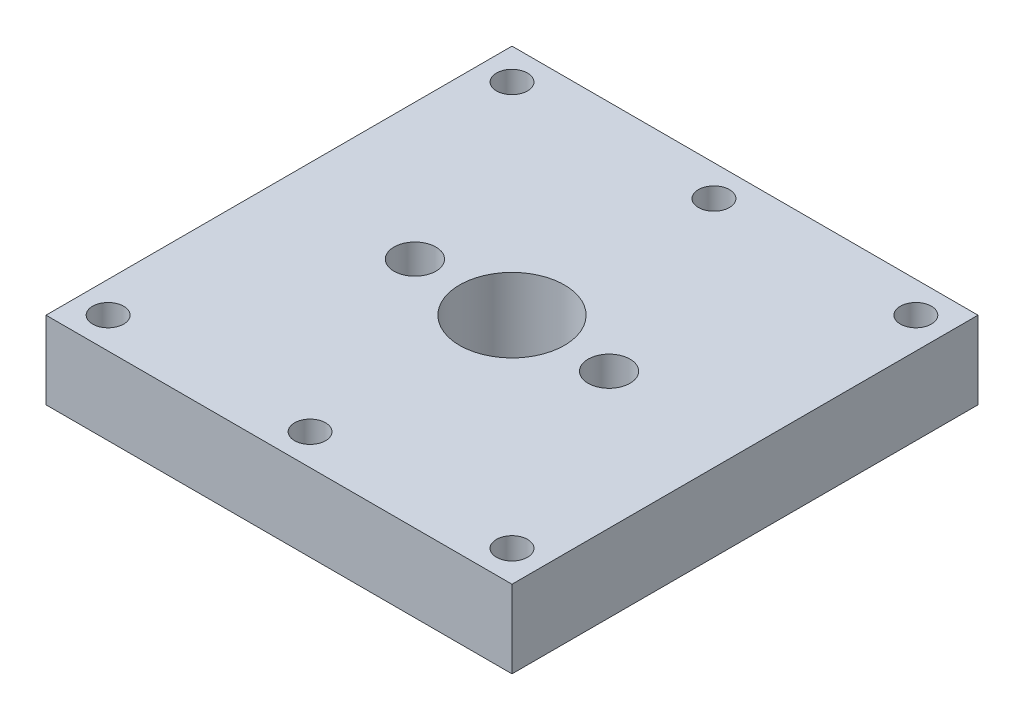
ISO-10303-21;
HEADER;
FILE_DESCRIPTION(('STEP AP214'),'2;1');
FILE_NAME('part.step','',(''),(''),'','','');
FILE_SCHEMA(('AUTOMOTIVE_DESIGN { 1 0 10303 214 1 1 1 1 }'));
ENDSEC;
DATA;
#1=APPLICATION_CONTEXT('core data for automotive mechanical design processes');
#2=APPLICATION_PROTOCOL_DEFINITION('international standard','automotive_design',2000,#1);
#3=PRODUCT_CONTEXT('',#1,'mechanical');
#4=PRODUCT('Part','Part','',(#3));
#5=PRODUCT_RELATED_PRODUCT_CATEGORY('part','',(#4));
#6=PRODUCT_DEFINITION_FORMATION('','',#4);
#7=PRODUCT_DEFINITION_CONTEXT('part definition',#1,'design');
#8=PRODUCT_DEFINITION('design','',#6,#7);
#9=PRODUCT_DEFINITION_SHAPE('','',#8);
#10=(LENGTH_UNIT() NAMED_UNIT(*) SI_UNIT(.MILLI.,.METRE.));
#11=(NAMED_UNIT(*) PLANE_ANGLE_UNIT() SI_UNIT($,.RADIAN.));
#12=(NAMED_UNIT(*) SI_UNIT($,.STERADIAN.) SOLID_ANGLE_UNIT());
#13=UNCERTAINTY_MEASURE_WITH_UNIT(LENGTH_MEASURE(1.E-05),#10,'distance_accuracy_value','');
#14=(GEOMETRIC_REPRESENTATION_CONTEXT(3) GLOBAL_UNCERTAINTY_ASSIGNED_CONTEXT((#13)) GLOBAL_UNIT_ASSIGNED_CONTEXT((#10,
#11,#12)) REPRESENTATION_CONTEXT('',''));
#15=CARTESIAN_POINT('',(0.,0.,0.));
#16=DIRECTION('',(0.,0.,1.));
#17=DIRECTION('',(1.,0.,0.));
#18=AXIS2_PLACEMENT_3D('',#15,#16,#17);
#19=CARTESIAN_POINT('',(-30.,10.,30.));
#20=DIRECTION('',(1.,0.,0.));
#21=DIRECTION('',(0.,0.,-1.));
#22=AXIS2_PLACEMENT_3D('',#19,#20,#21);
#23=PLANE('',#22);
#24=DIRECTION('',(0.,0.,1.));
#25=VECTOR('',#24,1.);
#26=CARTESIAN_POINT('',(-30.,0.,30.));
#27=LINE('',#26,#25);
#28=CARTESIAN_POINT('',(-30.,0.,-30.));
#29=VERTEX_POINT('',#28);
#30=CARTESIAN_POINT('',(-30.,0.,30.));
#31=VERTEX_POINT('',#30);
#32=EDGE_CURVE('E111',#29,#31,#27,.T.);
#33=ORIENTED_EDGE('',*,*,#32,.T.);
#34=DIRECTION('',(0.,-1.,0.));
#35=VECTOR('',#34,1.);
#36=CARTESIAN_POINT('',(-30.,10.,30.));
#37=LINE('',#36,#35);
#38=CARTESIAN_POINT('',(-30.,10.,30.));
#39=VERTEX_POINT('',#38);
#40=EDGE_CURVE('E13',#39,#31,#37,.T.);
#41=ORIENTED_EDGE('',*,*,#40,.F.);
#42=DIRECTION('',(0.,0.,1.));
#43=VECTOR('',#42,1.);
#44=CARTESIAN_POINT('',(-30.,10.,30.));
#45=LINE('',#44,#43);
#46=CARTESIAN_POINT('',(-30.,10.,-30.));
#47=VERTEX_POINT('',#46);
#48=EDGE_CURVE('E99',#47,#39,#45,.T.);
#49=ORIENTED_EDGE('',*,*,#48,.F.);
#50=DIRECTION('',(0.,-1.,0.));
#51=VECTOR('',#50,1.);
#52=CARTESIAN_POINT('',(-30.,10.,-30.));
#53=LINE('',#52,#51);
#54=EDGE_CURVE('E107',#47,#29,#53,.T.);
#55=ORIENTED_EDGE('',*,*,#54,.T.);
#56=EDGE_LOOP('',(#33,#41,#49,#55));
#57=FACE_BOUND('',#56,.T.);
#58=ADVANCED_FACE('F48',(#57),#23,.F.);
#59=CARTESIAN_POINT('',(30.,10.,30.));
#60=DIRECTION('',(0.,0.,-1.));
#61=DIRECTION('',(-1.,0.,0.));
#62=AXIS2_PLACEMENT_3D('',#59,#60,#61);
#63=PLANE('',#62);
#64=DIRECTION('',(1.,0.,0.));
#65=VECTOR('',#64,1.);
#66=CARTESIAN_POINT('',(30.,0.,30.));
#67=LINE('',#66,#65);
#68=CARTESIAN_POINT('',(30.,0.,30.));
#69=VERTEX_POINT('',#68);
#70=EDGE_CURVE('E103',#31,#69,#67,.T.);
#71=ORIENTED_EDGE('',*,*,#70,.T.);
#72=DIRECTION('',(0.,-1.,0.));
#73=VECTOR('',#72,1.);
#74=CARTESIAN_POINT('',(30.,10.,30.));
#75=LINE('',#74,#73);
#76=CARTESIAN_POINT('',(30.,10.,30.));
#77=VERTEX_POINT('',#76);
#78=EDGE_CURVE('E56',#77,#69,#75,.T.);
#79=ORIENTED_EDGE('',*,*,#78,.F.);
#80=DIRECTION('',(1.,0.,0.));
#81=VECTOR('',#80,1.);
#82=CARTESIAN_POINT('',(30.,10.,30.));
#83=LINE('',#82,#81);
#84=EDGE_CURVE('E94',#39,#77,#83,.T.);
#85=ORIENTED_EDGE('',*,*,#84,.F.);
#86=ORIENTED_EDGE('',*,*,#40,.T.);
#87=EDGE_LOOP('',(#71,#79,#85,#86));
#88=FACE_BOUND('',#87,.T.);
#89=ADVANCED_FACE('F102',(#88),#63,.F.);
#90=CARTESIAN_POINT('',(30.,10.,30.));
#91=DIRECTION('',(-1.,0.,0.));
#92=DIRECTION('',(0.,0.,1.));
#93=AXIS2_PLACEMENT_3D('',#90,#91,#92);
#94=PLANE('',#93);
#95=DIRECTION('',(0.,0.,-1.));
#96=VECTOR('',#95,1.);
#97=CARTESIAN_POINT('',(30.,0.,30.));
#98=LINE('',#97,#96);
#99=CARTESIAN_POINT('',(30.,0.,-30.));
#100=VERTEX_POINT('',#99);
#101=EDGE_CURVE('E81',#69,#100,#98,.T.);
#102=ORIENTED_EDGE('',*,*,#101,.T.);
#103=DIRECTION('',(0.,-1.,0.));
#104=VECTOR('',#103,1.);
#105=CARTESIAN_POINT('',(30.,10.,-30.));
#106=LINE('',#105,#104);
#107=CARTESIAN_POINT('',(30.,10.,-30.));
#108=VERTEX_POINT('',#107);
#109=EDGE_CURVE('E104',#108,#100,#106,.T.);
#110=ORIENTED_EDGE('',*,*,#109,.F.);
#111=DIRECTION('',(0.,0.,-1.));
#112=VECTOR('',#111,1.);
#113=CARTESIAN_POINT('',(30.,10.,30.));
#114=LINE('',#113,#112);
#115=EDGE_CURVE('E97',#77,#108,#114,.T.);
#116=ORIENTED_EDGE('',*,*,#115,.F.);
#117=ORIENTED_EDGE('',*,*,#78,.T.);
#118=EDGE_LOOP('',(#102,#110,#116,#117));
#119=FACE_BOUND('',#118,.T.);
#120=ADVANCED_FACE('F105',(#119),#94,.F.);
#121=CARTESIAN_POINT('',(30.,10.,-30.));
#122=DIRECTION('',(0.,0.,1.));
#123=DIRECTION('',(1.,0.,0.));
#124=AXIS2_PLACEMENT_3D('',#121,#122,#123);
#125=PLANE('',#124);
#126=DIRECTION('',(-1.,0.,0.));
#127=VECTOR('',#126,1.);
#128=CARTESIAN_POINT('',(30.,0.,-30.));
#129=LINE('',#128,#127);
#130=EDGE_CURVE('E87',#100,#29,#129,.T.);
#131=ORIENTED_EDGE('',*,*,#130,.T.);
#132=ORIENTED_EDGE('',*,*,#54,.F.);
#133=DIRECTION('',(-1.,0.,0.));
#134=VECTOR('',#133,1.);
#135=CARTESIAN_POINT('',(30.,10.,-30.));
#136=LINE('',#135,#134);
#137=EDGE_CURVE('E64',#108,#47,#136,.T.);
#138=ORIENTED_EDGE('',*,*,#137,.F.);
#139=ORIENTED_EDGE('',*,*,#109,.T.);
#140=EDGE_LOOP('',(#131,#132,#138,#139));
#141=FACE_BOUND('',#140,.T.);
#142=ADVANCED_FACE('F119',(#141),#125,.F.);
#143=CARTESIAN_POINT('',(0.,10.,0.));
#144=DIRECTION('',(0.,1.,0.));
#145=DIRECTION('',(0.,0.,1.));
#146=AXIS2_PLACEMENT_3D('',#143,#144,#145);
#147=PLANE('',#146);
#148=CARTESIAN_POINT('',(0.,10.,0.));
#149=DIRECTION('',(0.,1.,0.));
#150=DIRECTION('',(0.,0.,1.));
#151=AXIS2_PLACEMENT_3D('',#148,#149,#150);
#152=CIRCLE('',#151,6.75);
#153=CARTESIAN_POINT('',(0.,10.,6.75));
#154=VERTEX_POINT('',#153);
#155=EDGE_CURVE('E185',#154,#154,#152,.T.);
#156=ORIENTED_EDGE('',*,*,#155,.F.);
#157=EDGE_LOOP('',(#156));
#158=FACE_BOUND('',#157,.T.);
#159=CARTESIAN_POINT('',(-12.5,10.,0.));
#160=DIRECTION('',(0.,1.,0.));
#161=DIRECTION('',(0.,0.,1.));
#162=AXIS2_PLACEMENT_3D('',#159,#160,#161);
#163=CIRCLE('',#162,2.7);
#164=CARTESIAN_POINT('',(-12.5,10.,2.7));
#165=VERTEX_POINT('',#164);
#166=EDGE_CURVE('E167',#165,#165,#163,.T.);
#167=ORIENTED_EDGE('',*,*,#166,.F.);
#168=EDGE_LOOP('',(#167));
#169=FACE_BOUND('',#168,.T.);
#170=CARTESIAN_POINT('',(12.5,10.,0.));
#171=DIRECTION('',(0.,1.,0.));
#172=DIRECTION('',(0.,0.,1.));
#173=AXIS2_PLACEMENT_3D('',#170,#171,#172);
#174=CIRCLE('',#173,2.7);
#175=CARTESIAN_POINT('',(12.5,10.,2.7));
#176=VERTEX_POINT('',#175);
#177=EDGE_CURVE('E161',#176,#176,#174,.T.);
#178=ORIENTED_EDGE('',*,*,#177,.F.);
#179=EDGE_LOOP('',(#178));
#180=FACE_BOUND('',#179,.T.);
#181=CARTESIAN_POINT('',(0.,10.,-26.));
#182=DIRECTION('',(0.,1.,0.));
#183=DIRECTION('',(0.,0.,1.));
#184=AXIS2_PLACEMENT_3D('',#181,#182,#183);
#185=CIRCLE('',#184,2.);
#186=CARTESIAN_POINT('',(0.,10.,-24.));
#187=VERTEX_POINT('',#186);
#188=EDGE_CURVE('E155',#187,#187,#185,.T.);
#189=ORIENTED_EDGE('',*,*,#188,.F.);
#190=EDGE_LOOP('',(#189));
#191=FACE_BOUND('',#190,.T.);
#192=CARTESIAN_POINT('',(26.,10.,-26.));
#193=DIRECTION('',(0.,1.,0.));
#194=DIRECTION('',(0.,0.,1.));
#195=AXIS2_PLACEMENT_3D('',#192,#193,#194);
#196=CIRCLE('',#195,2.);
#197=CARTESIAN_POINT('',(26.,10.,-24.));
#198=VERTEX_POINT('',#197);
#199=EDGE_CURVE('E149',#198,#198,#196,.T.);
#200=ORIENTED_EDGE('',*,*,#199,.F.);
#201=EDGE_LOOP('',(#200));
#202=FACE_BOUND('',#201,.T.);
#203=CARTESIAN_POINT('',(26.,10.,26.));
#204=DIRECTION('',(0.,1.,0.));
#205=DIRECTION('',(0.,0.,1.));
#206=AXIS2_PLACEMENT_3D('',#203,#204,#205);
#207=CIRCLE('',#206,2.);
#208=CARTESIAN_POINT('',(26.,10.,28.));
#209=VERTEX_POINT('',#208);
#210=EDGE_CURVE('E143',#209,#209,#207,.T.);
#211=ORIENTED_EDGE('',*,*,#210,.F.);
#212=EDGE_LOOP('',(#211));
#213=FACE_BOUND('',#212,.T.);
#214=CARTESIAN_POINT('',(0.,10.,26.));
#215=DIRECTION('',(0.,1.,0.));
#216=DIRECTION('',(0.,0.,1.));
#217=AXIS2_PLACEMENT_3D('',#214,#215,#216);
#218=CIRCLE('',#217,2.);
#219=CARTESIAN_POINT('',(0.,10.,28.));
#220=VERTEX_POINT('',#219);
#221=EDGE_CURVE('E137',#220,#220,#218,.T.);
#222=ORIENTED_EDGE('',*,*,#221,.F.);
#223=EDGE_LOOP('',(#222));
#224=FACE_BOUND('',#223,.T.);
#225=CARTESIAN_POINT('',(-26.,10.,26.));
#226=DIRECTION('',(0.,1.,0.));
#227=DIRECTION('',(0.,0.,1.));
#228=AXIS2_PLACEMENT_3D('',#225,#226,#227);
#229=CIRCLE('',#228,2.);
#230=CARTESIAN_POINT('',(-26.,10.,28.));
#231=VERTEX_POINT('',#230);
#232=EDGE_CURVE('E131',#231,#231,#229,.T.);
#233=ORIENTED_EDGE('',*,*,#232,.F.);
#234=EDGE_LOOP('',(#233));
#235=FACE_BOUND('',#234,.T.);
#236=CARTESIAN_POINT('',(-26.,10.,-26.));
#237=DIRECTION('',(0.,1.,0.));
#238=DIRECTION('',(0.,0.,1.));
#239=AXIS2_PLACEMENT_3D('',#236,#237,#238);
#240=CIRCLE('',#239,2.);
#241=CARTESIAN_POINT('',(-26.,10.,-24.));
#242=VERTEX_POINT('',#241);
#243=EDGE_CURVE('E125',#242,#242,#240,.T.);
#244=ORIENTED_EDGE('',*,*,#243,.F.);
#245=EDGE_LOOP('',(#244));
#246=FACE_BOUND('',#245,.T.);
#247=ORIENTED_EDGE('',*,*,#48,.T.);
#248=ORIENTED_EDGE('',*,*,#84,.T.);
#249=ORIENTED_EDGE('',*,*,#115,.T.);
#250=ORIENTED_EDGE('',*,*,#137,.T.);
#251=EDGE_LOOP('',(#247,#248,#249,#250));
#252=FACE_BOUND('',#251,.T.);
#253=ADVANCED_FACE('F95',(#158,#169,#180,#191,#202,#213,#224,#235,#246,#252),#147,.T.);
#254=CARTESIAN_POINT('',(0.,0.,0.));
#255=DIRECTION('',(0.,1.,0.));
#256=DIRECTION('',(0.,0.,1.));
#257=AXIS2_PLACEMENT_3D('',#254,#255,#256);
#258=PLANE('',#257);
#259=CARTESIAN_POINT('',(0.,0.,0.));
#260=DIRECTION('',(0.,1.,0.));
#261=DIRECTION('',(0.,0.,1.));
#262=AXIS2_PLACEMENT_3D('',#259,#260,#261);
#263=CIRCLE('',#262,6.75);
#264=CARTESIAN_POINT('',(0.,0.,6.75));
#265=VERTEX_POINT('',#264);
#266=EDGE_CURVE('E182',#265,#265,#263,.T.);
#267=ORIENTED_EDGE('',*,*,#266,.T.);
#268=EDGE_LOOP('',(#267));
#269=FACE_BOUND('',#268,.T.);
#270=CARTESIAN_POINT('',(-12.5,0.,0.));
#271=DIRECTION('',(0.,-1.,0.));
#272=DIRECTION('',(0.,0.,-1.));
#273=AXIS2_PLACEMENT_3D('',#270,#271,#272);
#274=CIRCLE('',#273,0.500000000000001);
#275=CARTESIAN_POINT('',(-12.5,0.,-0.500000000000001));
#276=VERTEX_POINT('',#275);
#277=EDGE_CURVE('E179',#276,#276,#274,.T.);
#278=ORIENTED_EDGE('',*,*,#277,.F.);
#279=EDGE_LOOP('',(#278));
#280=FACE_BOUND('',#279,.T.);
#281=CARTESIAN_POINT('',(12.5,0.,0.));
#282=DIRECTION('',(0.,-1.,0.));
#283=DIRECTION('',(0.,0.,-1.));
#284=AXIS2_PLACEMENT_3D('',#281,#282,#283);
#285=CIRCLE('',#284,0.500000000000001);
#286=CARTESIAN_POINT('',(12.5,0.,-0.500000000000001));
#287=VERTEX_POINT('',#286);
#288=EDGE_CURVE('E173',#287,#287,#285,.T.);
#289=ORIENTED_EDGE('',*,*,#288,.F.);
#290=EDGE_LOOP('',(#289));
#291=FACE_BOUND('',#290,.T.);
#292=CARTESIAN_POINT('',(0.,0.,-26.));
#293=DIRECTION('',(0.,1.,0.));
#294=DIRECTION('',(0.,0.,1.));
#295=AXIS2_PLACEMENT_3D('',#292,#293,#294);
#296=CIRCLE('',#295,2.);
#297=CARTESIAN_POINT('',(0.,0.,-24.));
#298=VERTEX_POINT('',#297);
#299=EDGE_CURVE('E152',#298,#298,#296,.T.);
#300=ORIENTED_EDGE('',*,*,#299,.T.);
#301=EDGE_LOOP('',(#300));
#302=FACE_BOUND('',#301,.T.);
#303=CARTESIAN_POINT('',(26.,0.,-26.));
#304=DIRECTION('',(0.,1.,0.));
#305=DIRECTION('',(0.,0.,1.));
#306=AXIS2_PLACEMENT_3D('',#303,#304,#305);
#307=CIRCLE('',#306,2.);
#308=CARTESIAN_POINT('',(26.,0.,-24.));
#309=VERTEX_POINT('',#308);
#310=EDGE_CURVE('E146',#309,#309,#307,.T.);
#311=ORIENTED_EDGE('',*,*,#310,.T.);
#312=EDGE_LOOP('',(#311));
#313=FACE_BOUND('',#312,.T.);
#314=CARTESIAN_POINT('',(26.,0.,26.));
#315=DIRECTION('',(0.,1.,0.));
#316=DIRECTION('',(0.,0.,1.));
#317=AXIS2_PLACEMENT_3D('',#314,#315,#316);
#318=CIRCLE('',#317,2.);
#319=CARTESIAN_POINT('',(26.,0.,28.));
#320=VERTEX_POINT('',#319);
#321=EDGE_CURVE('E140',#320,#320,#318,.T.);
#322=ORIENTED_EDGE('',*,*,#321,.T.);
#323=EDGE_LOOP('',(#322));
#324=FACE_BOUND('',#323,.T.);
#325=CARTESIAN_POINT('',(0.,0.,26.));
#326=DIRECTION('',(0.,1.,0.));
#327=DIRECTION('',(0.,0.,1.));
#328=AXIS2_PLACEMENT_3D('',#325,#326,#327);
#329=CIRCLE('',#328,2.);
#330=CARTESIAN_POINT('',(0.,0.,28.));
#331=VERTEX_POINT('',#330);
#332=EDGE_CURVE('E134',#331,#331,#329,.T.);
#333=ORIENTED_EDGE('',*,*,#332,.T.);
#334=EDGE_LOOP('',(#333));
#335=FACE_BOUND('',#334,.T.);
#336=CARTESIAN_POINT('',(-26.,0.,26.));
#337=DIRECTION('',(0.,1.,0.));
#338=DIRECTION('',(0.,0.,1.));
#339=AXIS2_PLACEMENT_3D('',#336,#337,#338);
#340=CIRCLE('',#339,2.);
#341=CARTESIAN_POINT('',(-26.,0.,28.));
#342=VERTEX_POINT('',#341);
#343=EDGE_CURVE('E128',#342,#342,#340,.T.);
#344=ORIENTED_EDGE('',*,*,#343,.T.);
#345=EDGE_LOOP('',(#344));
#346=FACE_BOUND('',#345,.T.);
#347=CARTESIAN_POINT('',(-26.,0.,-26.));
#348=DIRECTION('',(0.,1.,0.));
#349=DIRECTION('',(0.,0.,1.));
#350=AXIS2_PLACEMENT_3D('',#347,#348,#349);
#351=CIRCLE('',#350,2.);
#352=CARTESIAN_POINT('',(-26.,0.,-24.));
#353=VERTEX_POINT('',#352);
#354=EDGE_CURVE('E114',#353,#353,#351,.T.);
#355=ORIENTED_EDGE('',*,*,#354,.T.);
#356=EDGE_LOOP('',(#355));
#357=FACE_BOUND('',#356,.T.);
#358=ORIENTED_EDGE('',*,*,#32,.F.);
#359=ORIENTED_EDGE('',*,*,#130,.F.);
#360=ORIENTED_EDGE('',*,*,#101,.F.);
#361=ORIENTED_EDGE('',*,*,#70,.F.);
#362=EDGE_LOOP('',(#358,#359,#360,#361));
#363=FACE_BOUND('',#362,.T.);
#364=ADVANCED_FACE('F122',(#269,#280,#291,#302,#313,#324,#335,#346,#357,#363),#258,.F.);
#365=CARTESIAN_POINT('',(-26.,0.,-26.));
#366=DIRECTION('',(0.,1.,0.));
#367=DIRECTION('',(0.,0.,1.));
#368=AXIS2_PLACEMENT_3D('',#365,#366,#367);
#369=CYLINDRICAL_SURFACE('',#368,2.);
#370=ORIENTED_EDGE('',*,*,#354,.F.);
#371=EDGE_LOOP('',(#370));
#372=FACE_BOUND('',#371,.T.);
#373=ORIENTED_EDGE('',*,*,#243,.T.);
#374=EDGE_LOOP('',(#373));
#375=FACE_BOUND('',#374,.T.);
#376=ADVANCED_FACE('F219',(#372,#375),#369,.F.);
#377=CARTESIAN_POINT('',(-26.,0.,26.));
#378=DIRECTION('',(0.,1.,0.));
#379=DIRECTION('',(0.,0.,1.));
#380=AXIS2_PLACEMENT_3D('',#377,#378,#379);
#381=CYLINDRICAL_SURFACE('',#380,2.);
#382=ORIENTED_EDGE('',*,*,#343,.F.);
#383=EDGE_LOOP('',(#382));
#384=FACE_BOUND('',#383,.T.);
#385=ORIENTED_EDGE('',*,*,#232,.T.);
#386=EDGE_LOOP('',(#385));
#387=FACE_BOUND('',#386,.T.);
#388=ADVANCED_FACE('F221',(#384,#387),#381,.F.);
#389=CARTESIAN_POINT('',(0.,0.,26.));
#390=DIRECTION('',(0.,1.,0.));
#391=DIRECTION('',(0.,0.,1.));
#392=AXIS2_PLACEMENT_3D('',#389,#390,#391);
#393=CYLINDRICAL_SURFACE('',#392,2.);
#394=ORIENTED_EDGE('',*,*,#332,.F.);
#395=EDGE_LOOP('',(#394));
#396=FACE_BOUND('',#395,.T.);
#397=ORIENTED_EDGE('',*,*,#221,.T.);
#398=EDGE_LOOP('',(#397));
#399=FACE_BOUND('',#398,.T.);
#400=ADVANCED_FACE('F228',(#396,#399),#393,.F.);
#401=CARTESIAN_POINT('',(26.,0.,26.));
#402=DIRECTION('',(0.,1.,0.));
#403=DIRECTION('',(0.,0.,1.));
#404=AXIS2_PLACEMENT_3D('',#401,#402,#403);
#405=CYLINDRICAL_SURFACE('',#404,2.);
#406=ORIENTED_EDGE('',*,*,#321,.F.);
#407=EDGE_LOOP('',(#406));
#408=FACE_BOUND('',#407,.T.);
#409=ORIENTED_EDGE('',*,*,#210,.T.);
#410=EDGE_LOOP('',(#409));
#411=FACE_BOUND('',#410,.T.);
#412=ADVANCED_FACE('F330',(#408,#411),#405,.F.);
#413=CARTESIAN_POINT('',(26.,0.,-26.));
#414=DIRECTION('',(0.,1.,0.));
#415=DIRECTION('',(0.,0.,1.));
#416=AXIS2_PLACEMENT_3D('',#413,#414,#415);
#417=CYLINDRICAL_SURFACE('',#416,2.);
#418=ORIENTED_EDGE('',*,*,#310,.F.);
#419=EDGE_LOOP('',(#418));
#420=FACE_BOUND('',#419,.T.);
#421=ORIENTED_EDGE('',*,*,#199,.T.);
#422=EDGE_LOOP('',(#421));
#423=FACE_BOUND('',#422,.T.);
#424=ADVANCED_FACE('F322',(#420,#423),#417,.F.);
#425=CARTESIAN_POINT('',(0.,0.,-26.));
#426=DIRECTION('',(0.,1.,0.));
#427=DIRECTION('',(0.,0.,1.));
#428=AXIS2_PLACEMENT_3D('',#425,#426,#427);
#429=CYLINDRICAL_SURFACE('',#428,2.);
#430=ORIENTED_EDGE('',*,*,#299,.F.);
#431=EDGE_LOOP('',(#430));
#432=FACE_BOUND('',#431,.T.);
#433=ORIENTED_EDGE('',*,*,#188,.T.);
#434=EDGE_LOOP('',(#433));
#435=FACE_BOUND('',#434,.T.);
#436=ADVANCED_FACE('F313',(#432,#435),#429,.F.);
#437=CARTESIAN_POINT('',(12.5,3.,0.));
#438=DIRECTION('',(0.,1.,0.));
#439=DIRECTION('',(0.,0.,1.));
#440=AXIS2_PLACEMENT_3D('',#437,#438,#439);
#441=CYLINDRICAL_SURFACE('',#440,2.7);
#442=CARTESIAN_POINT('',(12.5,3.,0.));
#443=DIRECTION('',(0.,1.,0.));
#444=DIRECTION('',(0.,0.,1.));
#445=AXIS2_PLACEMENT_3D('',#442,#443,#444);
#446=CIRCLE('',#445,2.7);
#447=CARTESIAN_POINT('',(12.5,3.,2.7));
#448=VERTEX_POINT('',#447);
#449=EDGE_CURVE('E158',#448,#448,#446,.T.);
#450=ORIENTED_EDGE('',*,*,#449,.F.);
#451=EDGE_LOOP('',(#450));
#452=FACE_BOUND('',#451,.T.);
#453=ORIENTED_EDGE('',*,*,#177,.T.);
#454=EDGE_LOOP('',(#453));
#455=FACE_BOUND('',#454,.T.);
#456=ADVANCED_FACE('F306',(#452,#455),#441,.F.);
#457=CARTESIAN_POINT('',(12.5,3.,0.));
#458=DIRECTION('',(0.,1.,0.));
#459=DIRECTION('',(0.,0.,1.));
#460=AXIS2_PLACEMENT_3D('',#457,#458,#459);
#461=PLANE('',#460);
#462=CARTESIAN_POINT('',(12.5,3.,0.));
#463=DIRECTION('',(0.,-1.,0.));
#464=DIRECTION('',(0.,0.,-1.));
#465=AXIS2_PLACEMENT_3D('',#462,#463,#464);
#466=CIRCLE('',#465,0.500000000000001);
#467=CARTESIAN_POINT('',(12.5,3.,-0.500000000000001));
#468=VERTEX_POINT('',#467);
#469=EDGE_CURVE('E170',#468,#468,#466,.T.);
#470=ORIENTED_EDGE('',*,*,#469,.T.);
#471=EDGE_LOOP('',(#470));
#472=FACE_BOUND('',#471,.T.);
#473=ORIENTED_EDGE('',*,*,#449,.T.);
#474=EDGE_LOOP('',(#473));
#475=FACE_BOUND('',#474,.T.);
#476=ADVANCED_FACE('F298',(#472,#475),#461,.T.);
#477=CARTESIAN_POINT('',(-12.5,3.,0.));
#478=DIRECTION('',(0.,1.,0.));
#479=DIRECTION('',(0.,0.,1.));
#480=AXIS2_PLACEMENT_3D('',#477,#478,#479);
#481=CYLINDRICAL_SURFACE('',#480,2.7);
#482=CARTESIAN_POINT('',(-12.5,3.,0.));
#483=DIRECTION('',(0.,1.,0.));
#484=DIRECTION('',(0.,0.,1.));
#485=AXIS2_PLACEMENT_3D('',#482,#483,#484);
#486=CIRCLE('',#485,2.7);
#487=CARTESIAN_POINT('',(-12.5,3.,2.7));
#488=VERTEX_POINT('',#487);
#489=EDGE_CURVE('E164',#488,#488,#486,.T.);
#490=ORIENTED_EDGE('',*,*,#489,.F.);
#491=EDGE_LOOP('',(#490));
#492=FACE_BOUND('',#491,.T.);
#493=ORIENTED_EDGE('',*,*,#166,.T.);
#494=EDGE_LOOP('',(#493));
#495=FACE_BOUND('',#494,.T.);
#496=ADVANCED_FACE('F289',(#492,#495),#481,.F.);
#497=CARTESIAN_POINT('',(-12.5,3.,0.));
#498=DIRECTION('',(0.,1.,0.));
#499=DIRECTION('',(0.,0.,1.));
#500=AXIS2_PLACEMENT_3D('',#497,#498,#499);
#501=PLANE('',#500);
#502=CARTESIAN_POINT('',(-12.5,3.,0.));
#503=DIRECTION('',(0.,-1.,0.));
#504=DIRECTION('',(0.,0.,-1.));
#505=AXIS2_PLACEMENT_3D('',#502,#503,#504);
#506=CIRCLE('',#505,0.500000000000001);
#507=CARTESIAN_POINT('',(-12.5,3.,-0.500000000000001));
#508=VERTEX_POINT('',#507);
#509=EDGE_CURVE('E176',#508,#508,#506,.T.);
#510=ORIENTED_EDGE('',*,*,#509,.T.);
#511=EDGE_LOOP('',(#510));
#512=FACE_BOUND('',#511,.T.);
#513=ORIENTED_EDGE('',*,*,#489,.T.);
#514=EDGE_LOOP('',(#513));
#515=FACE_BOUND('',#514,.T.);
#516=ADVANCED_FACE('F281',(#512,#515),#501,.T.);
#517=CARTESIAN_POINT('',(12.5,3.,0.));
#518=DIRECTION('',(0.,-1.,0.));
#519=DIRECTION('',(0.,0.,-1.));
#520=AXIS2_PLACEMENT_3D('',#517,#518,#519);
#521=CYLINDRICAL_SURFACE('',#520,0.500000000000001);
#522=ORIENTED_EDGE('',*,*,#469,.F.);
#523=EDGE_LOOP('',(#522));
#524=FACE_BOUND('',#523,.T.);
#525=ORIENTED_EDGE('',*,*,#288,.T.);
#526=EDGE_LOOP('',(#525));
#527=FACE_BOUND('',#526,.T.);
#528=ADVANCED_FACE('F274',(#524,#527),#521,.F.);
#529=CARTESIAN_POINT('',(-12.5,3.,0.));
#530=DIRECTION('',(0.,-1.,0.));
#531=DIRECTION('',(0.,0.,-1.));
#532=AXIS2_PLACEMENT_3D('',#529,#530,#531);
#533=CYLINDRICAL_SURFACE('',#532,0.500000000000001);
#534=ORIENTED_EDGE('',*,*,#509,.F.);
#535=EDGE_LOOP('',(#534));
#536=FACE_BOUND('',#535,.T.);
#537=ORIENTED_EDGE('',*,*,#277,.T.);
#538=EDGE_LOOP('',(#537));
#539=FACE_BOUND('',#538,.T.);
#540=ADVANCED_FACE('F196',(#536,#539),#533,.F.);
#541=CARTESIAN_POINT('',(0.,0.,0.));
#542=DIRECTION('',(0.,1.,0.));
#543=DIRECTION('',(0.,0.,1.));
#544=AXIS2_PLACEMENT_3D('',#541,#542,#543);
#545=CYLINDRICAL_SURFACE('',#544,6.75);
#546=ORIENTED_EDGE('',*,*,#266,.F.);
#547=EDGE_LOOP('',(#546));
#548=FACE_BOUND('',#547,.T.);
#549=ORIENTED_EDGE('',*,*,#155,.T.);
#550=EDGE_LOOP('',(#549));
#551=FACE_BOUND('',#550,.T.);
#552=ADVANCED_FACE('F193',(#548,#551),#545,.F.);
#553=CLOSED_SHELL('',(#58,#89,#120,#142,#253,#364,#376,#388,#400,#412,#424,#436,#456,#476,#496,
#516,#528,#540,#552));
#554=MANIFOLD_SOLID_BREP('B2',#553);
#555=ADVANCED_BREP_SHAPE_REPRESENTATION('',(#18,#554),#14);
#556=SHAPE_DEFINITION_REPRESENTATION(#9,#555);
ENDSEC;
END-ISO-10303-21;
